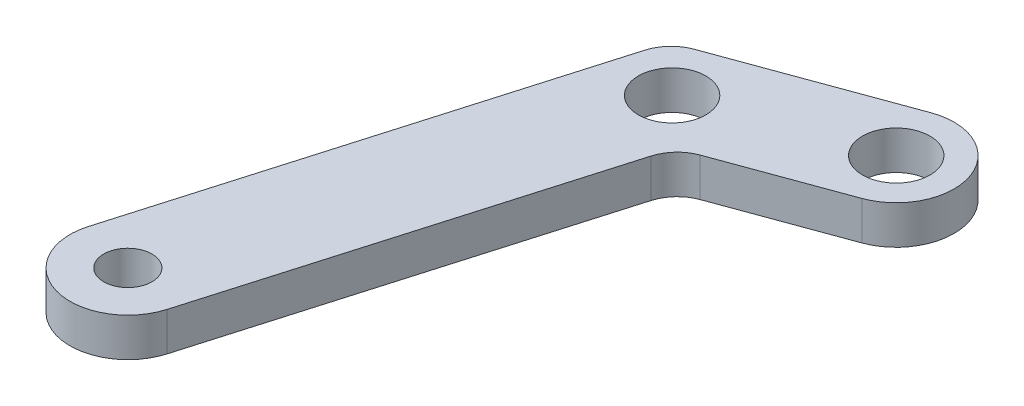
ISO-10303-21;
HEADER;
FILE_DESCRIPTION(('STEP AP214'),'2;1');
FILE_NAME('part.step','',(''),(''),'','','');
FILE_SCHEMA(('AUTOMOTIVE_DESIGN { 1 0 10303 214 1 1 1 1 }'));
ENDSEC;
DATA;
#1=APPLICATION_CONTEXT('core data for automotive mechanical design processes');
#2=APPLICATION_PROTOCOL_DEFINITION('international standard','automotive_design',2000,#1);
#3=PRODUCT_CONTEXT('',#1,'mechanical');
#4=PRODUCT('Part','Part','',(#3));
#5=PRODUCT_RELATED_PRODUCT_CATEGORY('part','',(#4));
#6=PRODUCT_DEFINITION_FORMATION('','',#4);
#7=PRODUCT_DEFINITION_CONTEXT('part definition',#1,'design');
#8=PRODUCT_DEFINITION('design','',#6,#7);
#9=PRODUCT_DEFINITION_SHAPE('','',#8);
#10=(LENGTH_UNIT() NAMED_UNIT(*) SI_UNIT(.MILLI.,.METRE.));
#11=(NAMED_UNIT(*) PLANE_ANGLE_UNIT() SI_UNIT($,.RADIAN.));
#12=(NAMED_UNIT(*) SI_UNIT($,.STERADIAN.) SOLID_ANGLE_UNIT());
#13=UNCERTAINTY_MEASURE_WITH_UNIT(LENGTH_MEASURE(1.E-05),#10,'distance_accuracy_value','');
#14=(GEOMETRIC_REPRESENTATION_CONTEXT(3) GLOBAL_UNCERTAINTY_ASSIGNED_CONTEXT((#13)) GLOBAL_UNIT_ASSIGNED_CONTEXT((#10,
#11,#12)) REPRESENTATION_CONTEXT('',''));
#15=CARTESIAN_POINT('',(0.,0.,0.));
#16=DIRECTION('',(0.,0.,1.));
#17=DIRECTION('',(1.,0.,0.));
#18=AXIS2_PLACEMENT_3D('',#15,#16,#17);
#19=CARTESIAN_POINT('',(-10889.2891918554,2.,-30384.0527578239));
#20=DIRECTION('',(0.,-1.,0.));
#21=DIRECTION('',(0.,0.,-1.));
#22=AXIS2_PLACEMENT_3D('',#19,#20,#21);
#23=PLANE('',#22);
#24=DIRECTION('',(-0.939204184590241,0.,0.343359140912515));
#25=VECTOR('',#24,1.);
#26=CARTESIAN_POINT('',(-10900.2526228413,2.,-30383.2388834211));
#27=LINE('',#26,#25);
#28=CARTESIAN_POINT('',(-10890.3192692782,2.,-30386.8703703776));
#29=VERTEX_POINT('',#28);
#30=CARTESIAN_POINT('',(-10899.3020627583,2.,-30383.5863941103));
#31=VERTEX_POINT('',#30);
#32=EDGE_CURVE('E109',#29,#31,#27,.T.);
#33=ORIENTED_EDGE('',*,*,#32,.T.);
#34=CARTESIAN_POINT('',(-10898.6153444765,2.,-30381.7079857412));
#35=DIRECTION('',(0.,-1.,0.));
#36=DIRECTION('',(0.,0.,-1.));
#37=AXIS2_PLACEMENT_3D('',#34,#35,#36);
#38=CIRCLE('',#37,2.);
#39=CARTESIAN_POINT('',(-10900.5355870711,2.,-30382.267153317));
#40=VERTEX_POINT('',#39);
#41=EDGE_CURVE('E153',#31,#40,#38,.F.);
#42=ORIENTED_EDGE('',*,*,#41,.T.);
#43=DIRECTION('',(-0.279583787923326,0.,0.960121297300734));
#44=VECTOR('',#43,1.);
#45=CARTESIAN_POINT('',(-10907.0393017095,2.,-30359.9326861352));
#46=LINE('',#45,#44);
#47=CARTESIAN_POINT('',(-10907.0393017095,2.,-30359.9326861352));
#48=VERTEX_POINT('',#47);
#49=EDGE_CURVE('E120',#40,#48,#46,.T.);
#50=ORIENTED_EDGE('',*,*,#49,.T.);
#51=CARTESIAN_POINT('',(-10904.1589378176,2.,-30359.0939347715));
#52=DIRECTION('',(0.,1.,0.));
#53=DIRECTION('',(0.,0.,1.));
#54=AXIS2_PLACEMENT_3D('',#51,#52,#53);
#55=CIRCLE('',#54,2.9999999999985);
#56=CARTESIAN_POINT('',(-10901.2785739257,2.,-30358.2551834077));
#57=VERTEX_POINT('',#56);
#58=EDGE_CURVE('E187',#48,#57,#55,.T.);
#59=ORIENTED_EDGE('',*,*,#58,.T.);
#60=DIRECTION('',(0.279583787923342,0.,-0.960121297300729));
#61=VECTOR('',#60,1.);
#62=CARTESIAN_POINT('',(-10901.2785739257,2.,-30358.2551834077));
#63=LINE('',#62,#61);
#64=CARTESIAN_POINT('',(-10895.6237519765,2.,-30377.6744602771));
#65=VERTEX_POINT('',#64);
#66=EDGE_CURVE('E182',#57,#65,#63,.T.);
#67=ORIENTED_EDGE('',*,*,#66,.T.);
#68=CARTESIAN_POINT('',(-10893.7035093819,2.,-30377.1152927013));
#69=DIRECTION('',(0.,-1.,0.));
#70=DIRECTION('',(0.,0.,-1.));
#71=AXIS2_PLACEMENT_3D('',#68,#69,#70);
#72=CIRCLE('',#71,2.);
#73=CARTESIAN_POINT('',(-10894.3902276637,2.,-30378.9937010704));
#74=VERTEX_POINT('',#73);
#75=EDGE_CURVE('E11',#65,#74,#72,.T.);
#76=ORIENTED_EDGE('',*,*,#75,.T.);
#77=DIRECTION('',(0.939204184590073,0.,-0.343359140912974));
#78=VECTOR('',#77,1.);
#79=CARTESIAN_POINT('',(-10895.3407877468,2.,-30378.6461903812));
#80=LINE('',#79,#78);
#81=CARTESIAN_POINT('',(-10888.2591144327,2.,-30381.2351452701));
#82=VERTEX_POINT('',#81);
#83=EDGE_CURVE('E125',#74,#82,#80,.T.);
#84=ORIENTED_EDGE('',*,*,#83,.T.);
#85=CARTESIAN_POINT('',(-10889.2891918554,2.,-30384.0527578239));
#86=DIRECTION('',(0.,1.,0.));
#87=DIRECTION('',(0.,0.,-1.));
#88=AXIS2_PLACEMENT_3D('',#85,#86,#87);
#89=CIRCLE('',#88,2.99999999999489);
#90=EDGE_CURVE('E121',#82,#29,#89,.T.);
#91=ORIENTED_EDGE('',*,*,#90,.T.);
#92=EDGE_LOOP('',(#33,#42,#50,#59,#67,#76,#84,#91));
#93=FACE_BOUND('',#92,.T.);
#94=CARTESIAN_POINT('',(-10889.2891918554,2.,-30384.0527578239));
#95=DIRECTION('',(0.,1.,0.));
#96=DIRECTION('',(0.,0.,1.));
#97=AXIS2_PLACEMENT_3D('',#94,#95,#96);
#98=CIRCLE('',#97,1.74999999999929);
#99=CARTESIAN_POINT('',(-10889.2891918554,2.,-30382.3027578239));
#100=VERTEX_POINT('',#99);
#101=EDGE_CURVE('E194',#100,#100,#98,.T.);
#102=ORIENTED_EDGE('',*,*,#101,.F.);
#103=EDGE_LOOP('',(#102));
#104=FACE_BOUND('',#103,.T.);
#105=CARTESIAN_POINT('',(-10897.796705294,2.,-30380.9425369012));
#106=DIRECTION('',(0.,1.,0.));
#107=DIRECTION('',(0.,0.,1.));
#108=AXIS2_PLACEMENT_3D('',#105,#106,#107);
#109=CIRCLE('',#108,1.74999999999929);
#110=CARTESIAN_POINT('',(-10897.796705294,2.,-30379.1925369012));
#111=VERTEX_POINT('',#110);
#112=EDGE_CURVE('E211',#111,#111,#109,.T.);
#113=ORIENTED_EDGE('',*,*,#112,.F.);
#114=EDGE_LOOP('',(#113));
#115=FACE_BOUND('',#114,.T.);
#116=CARTESIAN_POINT('',(-10904.1589378176,2.,-30359.0939347715));
#117=DIRECTION('',(0.,1.,0.));
#118=DIRECTION('',(0.,0.,1.));
#119=AXIS2_PLACEMENT_3D('',#116,#117,#118);
#120=CIRCLE('',#119,1.2499999999991);
#121=CARTESIAN_POINT('',(-10904.1589378176,2.,-30357.8439347715));
#122=VERTEX_POINT('',#121);
#123=EDGE_CURVE('E219',#122,#122,#120,.T.);
#124=ORIENTED_EDGE('',*,*,#123,.F.);
#125=EDGE_LOOP('',(#124));
#126=FACE_BOUND('',#125,.T.);
#127=ADVANCED_FACE('F43',(#93,#104,#115,#126),#23,.F.);
#128=CARTESIAN_POINT('',(-10889.2891918554,0.,-30384.0527578239));
#129=DIRECTION('',(0.,-1.,0.));
#130=DIRECTION('',(0.,0.,-1.));
#131=AXIS2_PLACEMENT_3D('',#128,#129,#130);
#132=PLANE('',#131);
#133=CARTESIAN_POINT('',(-10897.796705294,0.,-30380.9425369012));
#134=DIRECTION('',(0.,1.,0.));
#135=DIRECTION('',(0.,0.,1.));
#136=AXIS2_PLACEMENT_3D('',#133,#134,#135);
#137=CIRCLE('',#136,1.74999999999929);
#138=CARTESIAN_POINT('',(-10897.796705294,0.,-30379.1925369012));
#139=VERTEX_POINT('',#138);
#140=EDGE_CURVE('E215',#139,#139,#137,.T.);
#141=ORIENTED_EDGE('',*,*,#140,.T.);
#142=EDGE_LOOP('',(#141));
#143=FACE_BOUND('',#142,.T.);
#144=DIRECTION('',(-0.279583787923326,0.,0.960121297300734));
#145=VECTOR('',#144,1.);
#146=CARTESIAN_POINT('',(-10907.0393017095,0.,-30359.9326861352));
#147=LINE('',#146,#145);
#148=CARTESIAN_POINT('',(-10900.5355870711,0.,-30382.267153317));
#149=VERTEX_POINT('',#148);
#150=CARTESIAN_POINT('',(-10907.0393017095,0.,-30359.9326861352));
#151=VERTEX_POINT('',#150);
#152=EDGE_CURVE('E197',#149,#151,#147,.T.);
#153=ORIENTED_EDGE('',*,*,#152,.F.);
#154=CARTESIAN_POINT('',(-10898.6153444765,0.,-30381.7079857412));
#155=DIRECTION('',(0.,-1.,0.));
#156=DIRECTION('',(0.,0.,-1.));
#157=AXIS2_PLACEMENT_3D('',#154,#155,#156);
#158=CIRCLE('',#157,2.);
#159=CARTESIAN_POINT('',(-10899.3020627583,0.,-30383.5863941103));
#160=VERTEX_POINT('',#159);
#161=EDGE_CURVE('E142',#149,#160,#158,.T.);
#162=ORIENTED_EDGE('',*,*,#161,.T.);
#163=DIRECTION('',(-0.939204184590241,0.,0.343359140912515));
#164=VECTOR('',#163,1.);
#165=CARTESIAN_POINT('',(-10900.2526228413,0.,-30383.2388834211));
#166=LINE('',#165,#164);
#167=CARTESIAN_POINT('',(-10890.3192692782,0.,-30386.8703703776));
#168=VERTEX_POINT('',#167);
#169=EDGE_CURVE('E193',#168,#160,#166,.T.);
#170=ORIENTED_EDGE('',*,*,#169,.F.);
#171=CARTESIAN_POINT('',(-10889.2891918554,0.,-30384.0527578239));
#172=DIRECTION('',(0.,1.,0.));
#173=DIRECTION('',(0.,0.,-1.));
#174=AXIS2_PLACEMENT_3D('',#171,#172,#173);
#175=CIRCLE('',#174,2.99999999999489);
#176=CARTESIAN_POINT('',(-10888.2591144327,0.,-30381.2351452701));
#177=VERTEX_POINT('',#176);
#178=EDGE_CURVE('E134',#177,#168,#175,.T.);
#179=ORIENTED_EDGE('',*,*,#178,.F.);
#180=DIRECTION('',(0.939204184590073,0.,-0.343359140912974));
#181=VECTOR('',#180,1.);
#182=CARTESIAN_POINT('',(-10895.3407877468,0.,-30378.6461903812));
#183=LINE('',#182,#181);
#184=CARTESIAN_POINT('',(-10894.3902276637,0.,-30378.9937010704));
#185=VERTEX_POINT('',#184);
#186=EDGE_CURVE('E130',#185,#177,#183,.T.);
#187=ORIENTED_EDGE('',*,*,#186,.F.);
#188=CARTESIAN_POINT('',(-10893.7035093819,0.,-30377.1152927013));
#189=DIRECTION('',(0.,-1.,0.));
#190=DIRECTION('',(0.,0.,-1.));
#191=AXIS2_PLACEMENT_3D('',#188,#189,#190);
#192=CIRCLE('',#191,2.);
#193=CARTESIAN_POINT('',(-10895.6237519765,0.,-30377.6744602771));
#194=VERTEX_POINT('',#193);
#195=EDGE_CURVE('E52',#185,#194,#192,.F.);
#196=ORIENTED_EDGE('',*,*,#195,.T.);
#197=DIRECTION('',(0.279583787923342,0.,-0.960121297300729));
#198=VECTOR('',#197,1.);
#199=CARTESIAN_POINT('',(-10901.2785739257,0.,-30358.2551834077));
#200=LINE('',#199,#198);
#201=CARTESIAN_POINT('',(-10901.2785739257,0.,-30358.2551834077));
#202=VERTEX_POINT('',#201);
#203=EDGE_CURVE('E169',#202,#194,#200,.T.);
#204=ORIENTED_EDGE('',*,*,#203,.F.);
#205=CARTESIAN_POINT('',(-10904.1589378176,0.,-30359.0939347715));
#206=DIRECTION('',(0.,1.,0.));
#207=DIRECTION('',(0.,0.,1.));
#208=AXIS2_PLACEMENT_3D('',#205,#206,#207);
#209=CIRCLE('',#208,2.9999999999985);
#210=EDGE_CURVE('E176',#151,#202,#209,.T.);
#211=ORIENTED_EDGE('',*,*,#210,.F.);
#212=EDGE_LOOP('',(#153,#162,#170,#179,#187,#196,#204,#211));
#213=FACE_BOUND('',#212,.T.);
#214=CARTESIAN_POINT('',(-10889.2891918554,0.,-30384.0527578239));
#215=DIRECTION('',(0.,1.,0.));
#216=DIRECTION('',(0.,0.,1.));
#217=AXIS2_PLACEMENT_3D('',#214,#215,#216);
#218=CIRCLE('',#217,1.74999999999929);
#219=CARTESIAN_POINT('',(-10889.2891918554,0.,-30382.3027578239));
#220=VERTEX_POINT('',#219);
#221=EDGE_CURVE('E207',#220,#220,#218,.T.);
#222=ORIENTED_EDGE('',*,*,#221,.T.);
#223=EDGE_LOOP('',(#222));
#224=FACE_BOUND('',#223,.T.);
#225=CARTESIAN_POINT('',(-10904.1589378176,0.,-30359.0939347715));
#226=DIRECTION('',(0.,1.,0.));
#227=DIRECTION('',(0.,0.,1.));
#228=AXIS2_PLACEMENT_3D('',#225,#226,#227);
#229=CIRCLE('',#228,1.2499999999991);
#230=CARTESIAN_POINT('',(-10904.1589378176,0.,-30357.8439347715));
#231=VERTEX_POINT('',#230);
#232=EDGE_CURVE('E223',#231,#231,#229,.T.);
#233=ORIENTED_EDGE('',*,*,#232,.T.);
#234=EDGE_LOOP('',(#233));
#235=FACE_BOUND('',#234,.T.);
#236=ADVANCED_FACE('F166',(#143,#213,#224,#235),#132,.T.);
#237=CARTESIAN_POINT('',(-10889.2891918554,2.,-30384.0527578239));
#238=DIRECTION('',(0.,-1.,0.));
#239=DIRECTION('',(0.,0.,-1.));
#240=AXIS2_PLACEMENT_3D('',#237,#238,#239);
#241=CYLINDRICAL_SURFACE('',#240,2.99999999999489);
#242=ORIENTED_EDGE('',*,*,#178,.T.);
#243=DIRECTION('',(0.,-1.,0.));
#244=VECTOR('',#243,1.);
#245=CARTESIAN_POINT('',(-10890.3192692782,2.,-30386.8703703776));
#246=LINE('',#245,#244);
#247=EDGE_CURVE('E114',#29,#168,#246,.T.);
#248=ORIENTED_EDGE('',*,*,#247,.F.);
#249=ORIENTED_EDGE('',*,*,#90,.F.);
#250=DIRECTION('',(0.,-1.,0.));
#251=VECTOR('',#250,1.);
#252=CARTESIAN_POINT('',(-10888.2591144327,2.,-30381.2351452701));
#253=LINE('',#252,#251);
#254=EDGE_CURVE('E180',#82,#177,#253,.T.);
#255=ORIENTED_EDGE('',*,*,#254,.T.);
#256=EDGE_LOOP('',(#242,#248,#249,#255));
#257=FACE_BOUND('',#256,.T.);
#258=ADVANCED_FACE('F132',(#257),#241,.T.);
#259=CARTESIAN_POINT('',(-10900.2526228413,2.,-30383.2388834211));
#260=DIRECTION('',(0.343359140912515,0.,0.939204184590241));
#261=DIRECTION('',(0.939204184590241,0.,-0.343359140912515));
#262=AXIS2_PLACEMENT_3D('',#259,#260,#261);
#263=PLANE('',#262);
#264=ORIENTED_EDGE('',*,*,#169,.T.);
#265=DIRECTION('',(0.,-1.,0.));
#266=VECTOR('',#265,1.);
#267=CARTESIAN_POINT('',(-10899.3020627583,2.,-30383.5863941103));
#268=LINE('',#267,#266);
#269=EDGE_CURVE('E117',#160,#31,#268,.F.);
#270=ORIENTED_EDGE('',*,*,#269,.T.);
#271=ORIENTED_EDGE('',*,*,#32,.F.);
#272=ORIENTED_EDGE('',*,*,#247,.T.);
#273=EDGE_LOOP('',(#264,#270,#271,#272));
#274=FACE_BOUND('',#273,.T.);
#275=ADVANCED_FACE('F112',(#274),#263,.F.);
#276=CARTESIAN_POINT('',(-10907.0393017095,2.,-30359.9326861352));
#277=DIRECTION('',(0.960121297300734,0.,0.279583787923326));
#278=DIRECTION('',(0.279583787923326,0.,-0.960121297300734));
#279=AXIS2_PLACEMENT_3D('',#276,#277,#278);
#280=PLANE('',#279);
#281=ORIENTED_EDGE('',*,*,#49,.F.);
#282=DIRECTION('',(0.,-1.,0.));
#283=VECTOR('',#282,1.);
#284=CARTESIAN_POINT('',(-10900.5355870711,2.,-30382.267153317));
#285=LINE('',#284,#283);
#286=EDGE_CURVE('E136',#40,#149,#285,.T.);
#287=ORIENTED_EDGE('',*,*,#286,.T.);
#288=ORIENTED_EDGE('',*,*,#152,.T.);
#289=DIRECTION('',(0.,-1.,0.));
#290=VECTOR('',#289,1.);
#291=CARTESIAN_POINT('',(-10907.0393017095,2.,-30359.9326861352));
#292=LINE('',#291,#290);
#293=EDGE_CURVE('E137',#48,#151,#292,.T.);
#294=ORIENTED_EDGE('',*,*,#293,.F.);
#295=EDGE_LOOP('',(#281,#287,#288,#294));
#296=FACE_BOUND('',#295,.T.);
#297=ADVANCED_FACE('F238',(#296),#280,.F.);
#298=CARTESIAN_POINT('',(-10904.1589378176,2.,-30359.0939347715));
#299=DIRECTION('',(0.,-1.,0.));
#300=DIRECTION('',(0.,0.,-1.));
#301=AXIS2_PLACEMENT_3D('',#298,#299,#300);
#302=CYLINDRICAL_SURFACE('',#301,2.9999999999985);
#303=ORIENTED_EDGE('',*,*,#210,.T.);
#304=DIRECTION('',(0.,-1.,0.));
#305=VECTOR('',#304,1.);
#306=CARTESIAN_POINT('',(-10901.2785739257,2.,-30358.2551834077));
#307=LINE('',#306,#305);
#308=EDGE_CURVE('E145',#57,#202,#307,.T.);
#309=ORIENTED_EDGE('',*,*,#308,.F.);
#310=ORIENTED_EDGE('',*,*,#58,.F.);
#311=ORIENTED_EDGE('',*,*,#293,.T.);
#312=EDGE_LOOP('',(#303,#309,#310,#311));
#313=FACE_BOUND('',#312,.T.);
#314=ADVANCED_FACE('F236',(#313),#302,.T.);
#315=CARTESIAN_POINT('',(-10901.2785739257,2.,-30358.2551834077));
#316=DIRECTION('',(-0.960121297300729,0.,-0.279583787923342));
#317=DIRECTION('',(-0.279583787923342,0.,0.96012129730073));
#318=AXIS2_PLACEMENT_3D('',#315,#316,#317);
#319=PLANE('',#318);
#320=ORIENTED_EDGE('',*,*,#203,.T.);
#321=DIRECTION('',(0.,-1.,0.));
#322=VECTOR('',#321,1.);
#323=CARTESIAN_POINT('',(-10895.6237519765,2.,-30377.6744602771));
#324=LINE('',#323,#322);
#325=EDGE_CURVE('E65',#194,#65,#324,.F.);
#326=ORIENTED_EDGE('',*,*,#325,.T.);
#327=ORIENTED_EDGE('',*,*,#66,.F.);
#328=ORIENTED_EDGE('',*,*,#308,.T.);
#329=EDGE_LOOP('',(#320,#326,#327,#328));
#330=FACE_BOUND('',#329,.T.);
#331=ADVANCED_FACE('F173',(#330),#319,.F.);
#332=CARTESIAN_POINT('',(-10895.3407877468,2.,-30378.6461903812));
#333=DIRECTION('',(-0.343359140912974,0.,-0.939204184590073));
#334=DIRECTION('',(-0.939204184590073,0.,0.343359140912974));
#335=AXIS2_PLACEMENT_3D('',#332,#333,#334);
#336=PLANE('',#335);
#337=ORIENTED_EDGE('',*,*,#83,.F.);
#338=DIRECTION('',(0.,-1.,0.));
#339=VECTOR('',#338,1.);
#340=CARTESIAN_POINT('',(-10894.3902276637,0.,-30378.9937010704));
#341=LINE('',#340,#339);
#342=EDGE_CURVE('E156',#74,#185,#341,.T.);
#343=ORIENTED_EDGE('',*,*,#342,.T.);
#344=ORIENTED_EDGE('',*,*,#186,.T.);
#345=ORIENTED_EDGE('',*,*,#254,.F.);
#346=EDGE_LOOP('',(#337,#343,#344,#345));
#347=FACE_BOUND('',#346,.T.);
#348=ADVANCED_FACE('F179',(#347),#336,.F.);
#349=CARTESIAN_POINT('',(-10889.2891918554,2.,-30384.0527578239));
#350=DIRECTION('',(0.,-1.,0.));
#351=DIRECTION('',(0.,0.,-1.));
#352=AXIS2_PLACEMENT_3D('',#349,#350,#351);
#353=CYLINDRICAL_SURFACE('',#352,1.74999999999929);
#354=ORIENTED_EDGE('',*,*,#101,.T.);
#355=EDGE_LOOP('',(#354));
#356=FACE_BOUND('',#355,.T.);
#357=ORIENTED_EDGE('',*,*,#221,.F.);
#358=EDGE_LOOP('',(#357));
#359=FACE_BOUND('',#358,.T.);
#360=ADVANCED_FACE('F260',(#356,#359),#353,.F.);
#361=CARTESIAN_POINT('',(-10897.796705294,2.,-30380.9425369012));
#362=DIRECTION('',(0.,-1.,0.));
#363=DIRECTION('',(0.,0.,-1.));
#364=AXIS2_PLACEMENT_3D('',#361,#362,#363);
#365=CYLINDRICAL_SURFACE('',#364,1.74999999999929);
#366=ORIENTED_EDGE('',*,*,#112,.T.);
#367=EDGE_LOOP('',(#366));
#368=FACE_BOUND('',#367,.T.);
#369=ORIENTED_EDGE('',*,*,#140,.F.);
#370=EDGE_LOOP('',(#369));
#371=FACE_BOUND('',#370,.T.);
#372=ADVANCED_FACE('F248',(#368,#371),#365,.F.);
#373=CARTESIAN_POINT('',(-10904.1589378176,2.,-30359.0939347715));
#374=DIRECTION('',(0.,-1.,0.));
#375=DIRECTION('',(0.,0.,-1.));
#376=AXIS2_PLACEMENT_3D('',#373,#374,#375);
#377=CYLINDRICAL_SURFACE('',#376,1.2499999999991);
#378=ORIENTED_EDGE('',*,*,#123,.T.);
#379=EDGE_LOOP('',(#378));
#380=FACE_BOUND('',#379,.T.);
#381=ORIENTED_EDGE('',*,*,#232,.F.);
#382=EDGE_LOOP('',(#381));
#383=FACE_BOUND('',#382,.T.);
#384=ADVANCED_FACE('F243',(#380,#383),#377,.F.);
#385=CARTESIAN_POINT('',(-10898.6153444765,2.,-30381.7079857412));
#386=DIRECTION('',(0.,-1.,0.));
#387=DIRECTION('',(0.,0.,-1.));
#388=AXIS2_PLACEMENT_3D('',#385,#386,#387);
#389=CYLINDRICAL_SURFACE('',#388,2.);
#390=ORIENTED_EDGE('',*,*,#41,.F.);
#391=ORIENTED_EDGE('',*,*,#269,.F.);
#392=ORIENTED_EDGE('',*,*,#161,.F.);
#393=ORIENTED_EDGE('',*,*,#286,.F.);
#394=EDGE_LOOP('',(#390,#391,#392,#393));
#395=FACE_BOUND('',#394,.T.);
#396=ADVANCED_FACE('F241',(#395),#389,.T.);
#397=CARTESIAN_POINT('',(-10893.7035093819,2.,-30377.1152927013));
#398=DIRECTION('',(0.,1.,0.));
#399=DIRECTION('',(0.,0.,1.));
#400=AXIS2_PLACEMENT_3D('',#397,#398,#399);
#401=CYLINDRICAL_SURFACE('',#400,2.);
#402=ORIENTED_EDGE('',*,*,#75,.F.);
#403=ORIENTED_EDGE('',*,*,#325,.F.);
#404=ORIENTED_EDGE('',*,*,#195,.F.);
#405=ORIENTED_EDGE('',*,*,#342,.F.);
#406=EDGE_LOOP('',(#402,#403,#404,#405));
#407=FACE_BOUND('',#406,.T.);
#408=ADVANCED_FACE('F45',(#407),#401,.F.);
#409=CLOSED_SHELL('',(#127,#236,#258,#275,#297,#314,#331,#348,#360,#372,#384,#396,#408));
#410=MANIFOLD_SOLID_BREP('B2',#409);
#411=ADVANCED_BREP_SHAPE_REPRESENTATION('',(#18,#410),#14);
#412=SHAPE_DEFINITION_REPRESENTATION(#9,#411);
ENDSEC;
END-ISO-10303-21;
